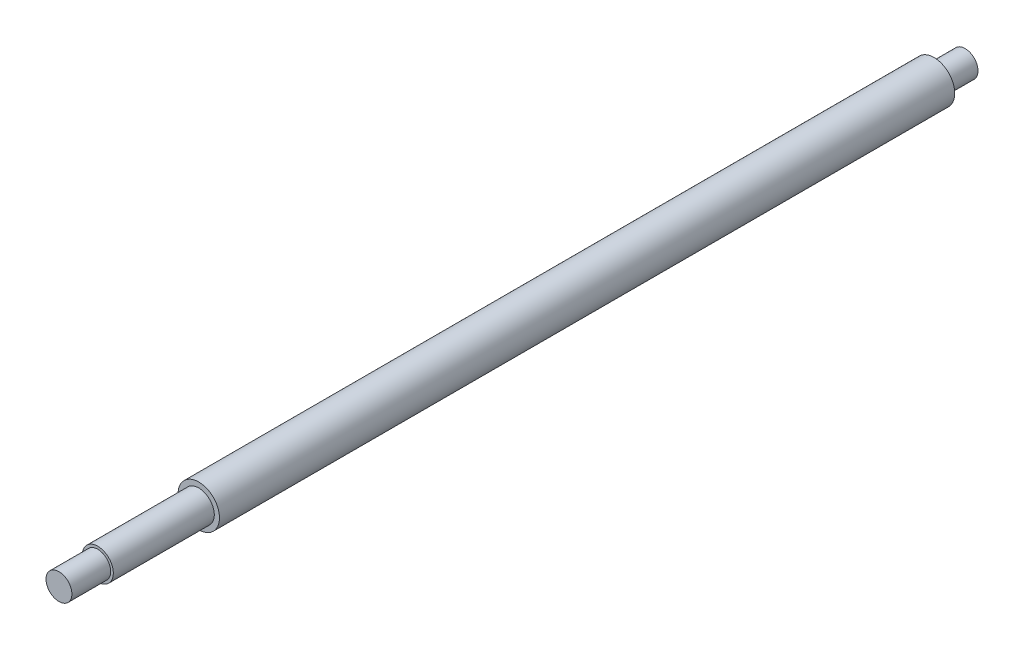
ISO-10303-21;
HEADER;
FILE_DESCRIPTION(('STEP AP214'),'2;1');
FILE_NAME('part.step','',(''),(''),'','','');
FILE_SCHEMA(('AUTOMOTIVE_DESIGN { 1 0 10303 214 1 1 1 1 }'));
ENDSEC;
DATA;
#1=APPLICATION_CONTEXT('core data for automotive mechanical design processes');
#2=APPLICATION_PROTOCOL_DEFINITION('international standard','automotive_design',2000,#1);
#3=PRODUCT_CONTEXT('',#1,'mechanical');
#4=PRODUCT('Part','Part','',(#3));
#5=PRODUCT_RELATED_PRODUCT_CATEGORY('part','',(#4));
#6=PRODUCT_DEFINITION_FORMATION('','',#4);
#7=PRODUCT_DEFINITION_CONTEXT('part definition',#1,'design');
#8=PRODUCT_DEFINITION('design','',#6,#7);
#9=PRODUCT_DEFINITION_SHAPE('','',#8);
#10=(LENGTH_UNIT() NAMED_UNIT(*) SI_UNIT(.MILLI.,.METRE.));
#11=(NAMED_UNIT(*) PLANE_ANGLE_UNIT() SI_UNIT($,.RADIAN.));
#12=(NAMED_UNIT(*) SI_UNIT($,.STERADIAN.) SOLID_ANGLE_UNIT());
#13=UNCERTAINTY_MEASURE_WITH_UNIT(LENGTH_MEASURE(1.E-05),#10,'distance_accuracy_value','');
#14=(GEOMETRIC_REPRESENTATION_CONTEXT(3) GLOBAL_UNCERTAINTY_ASSIGNED_CONTEXT((#13)) GLOBAL_UNIT_ASSIGNED_CONTEXT((#10,
#11,#12)) REPRESENTATION_CONTEXT('',''));
#15=CARTESIAN_POINT('',(0.,0.,0.));
#16=DIRECTION('',(0.,0.,1.));
#17=DIRECTION('',(1.,0.,0.));
#18=AXIS2_PLACEMENT_3D('',#15,#16,#17);
#19=CARTESIAN_POINT('',(0.,0.,338.680000000035));
#20=DIRECTION('',(0.,0.,1.));
#21=DIRECTION('',(1.,0.,0.));
#22=AXIS2_PLACEMENT_3D('',#19,#20,#21);
#23=PLANE('',#22);
#24=CARTESIAN_POINT('',(0.,0.,338.680000000035));
#25=DIRECTION('',(0.,0.,-1.));
#26=DIRECTION('',(-1.,0.,0.));
#27=AXIS2_PLACEMENT_3D('',#24,#25,#26);
#28=CIRCLE('',#27,4.99999999999996);
#29=CARTESIAN_POINT('',(-4.99999999999996,0.,338.680000000035));
#30=VERTEX_POINT('',#29);
#31=EDGE_CURVE('E12',#30,#30,#28,.T.);
#32=ORIENTED_EDGE('',*,*,#31,.F.);
#33=EDGE_LOOP('',(#32));
#34=FACE_BOUND('',#33,.T.);
#35=ADVANCED_FACE('F41',(#34),#23,.T.);
#36=CARTESIAN_POINT('',(0.,0.,0.));
#37=DIRECTION('',(0.,0.,-1.));
#38=DIRECTION('',(-1.,0.,0.));
#39=AXIS2_PLACEMENT_3D('',#36,#37,#38);
#40=CYLINDRICAL_SURFACE('',#39,4.99999999999996);
#41=ORIENTED_EDGE('',*,*,#31,.T.);
#42=EDGE_LOOP('',(#41));
#43=FACE_BOUND('',#42,.T.);
#44=CARTESIAN_POINT('',(0.,0.,323.680000000035));
#45=DIRECTION('',(0.,0.,-1.));
#46=DIRECTION('',(-1.,0.,0.));
#47=AXIS2_PLACEMENT_3D('',#44,#45,#46);
#48=CIRCLE('',#47,4.99999999999996);
#49=CARTESIAN_POINT('',(-4.99999999999996,0.,323.680000000035));
#50=VERTEX_POINT('',#49);
#51=EDGE_CURVE('E47',#50,#50,#48,.T.);
#52=ORIENTED_EDGE('',*,*,#51,.F.);
#53=EDGE_LOOP('',(#52));
#54=FACE_BOUND('',#53,.T.);
#55=ADVANCED_FACE('F89',(#43,#54),#40,.T.);
#56=CARTESIAN_POINT('',(0.,4.99999999999996,323.680000000035));
#57=DIRECTION('',(0.,0.,1.));
#58=DIRECTION('',(1.,0.,0.));
#59=AXIS2_PLACEMENT_3D('',#56,#57,#58);
#60=PLANE('',#59);
#61=ORIENTED_EDGE('',*,*,#51,.T.);
#62=EDGE_LOOP('',(#61));
#63=FACE_BOUND('',#62,.T.);
#64=CARTESIAN_POINT('',(0.,0.,323.680000000035));
#65=DIRECTION('',(0.,0.,-1.));
#66=DIRECTION('',(-1.,0.,0.));
#67=AXIS2_PLACEMENT_3D('',#64,#65,#66);
#68=CIRCLE('',#67,5.99999999999996);
#69=CARTESIAN_POINT('',(-5.99999999999996,0.,323.680000000035));
#70=VERTEX_POINT('',#69);
#71=EDGE_CURVE('E51',#70,#70,#68,.T.);
#72=ORIENTED_EDGE('',*,*,#71,.F.);
#73=EDGE_LOOP('',(#72));
#74=FACE_BOUND('',#73,.T.);
#75=ADVANCED_FACE('F94',(#63,#74),#60,.T.);
#76=CARTESIAN_POINT('',(0.,0.,0.));
#77=DIRECTION('',(0.,0.,-1.));
#78=DIRECTION('',(-1.,0.,0.));
#79=AXIS2_PLACEMENT_3D('',#76,#77,#78);
#80=CYLINDRICAL_SURFACE('',#79,5.99999999999996);
#81=ORIENTED_EDGE('',*,*,#71,.T.);
#82=EDGE_LOOP('',(#81));
#83=FACE_BOUND('',#82,.T.);
#84=CARTESIAN_POINT('',(0.,0.,284.680000000035));
#85=DIRECTION('',(0.,0.,-1.));
#86=DIRECTION('',(-1.,0.,0.));
#87=AXIS2_PLACEMENT_3D('',#84,#85,#86);
#88=CIRCLE('',#87,5.99999999999996);
#89=CARTESIAN_POINT('',(-5.99999999999996,0.,284.680000000035));
#90=VERTEX_POINT('',#89);
#91=EDGE_CURVE('E55',#90,#90,#88,.T.);
#92=ORIENTED_EDGE('',*,*,#91,.F.);
#93=EDGE_LOOP('',(#92));
#94=FACE_BOUND('',#93,.T.);
#95=ADVANCED_FACE('F98',(#83,#94),#80,.T.);
#96=CARTESIAN_POINT('',(0.,5.99999999999996,284.680000000035));
#97=DIRECTION('',(0.,0.,1.));
#98=DIRECTION('',(1.,0.,0.));
#99=AXIS2_PLACEMENT_3D('',#96,#97,#98);
#100=PLANE('',#99);
#101=ORIENTED_EDGE('',*,*,#91,.T.);
#102=EDGE_LOOP('',(#101));
#103=FACE_BOUND('',#102,.T.);
#104=CARTESIAN_POINT('',(0.,0.,284.680000000035));
#105=DIRECTION('',(0.,0.,-1.));
#106=DIRECTION('',(-1.,0.,0.));
#107=AXIS2_PLACEMENT_3D('',#104,#105,#106);
#108=CIRCLE('',#107,7.99999999999996);
#109=CARTESIAN_POINT('',(-7.99999999999996,0.,284.680000000035));
#110=VERTEX_POINT('',#109);
#111=EDGE_CURVE('E60',#110,#110,#108,.T.);
#112=ORIENTED_EDGE('',*,*,#111,.F.);
#113=EDGE_LOOP('',(#112));
#114=FACE_BOUND('',#113,.T.);
#115=ADVANCED_FACE('F104',(#103,#114),#100,.T.);
#116=CARTESIAN_POINT('',(0.,0.,0.));
#117=DIRECTION('',(0.,0.,-1.));
#118=DIRECTION('',(-1.,0.,0.));
#119=AXIS2_PLACEMENT_3D('',#116,#117,#118);
#120=CYLINDRICAL_SURFACE('',#119,7.99999999999997);
#121=ORIENTED_EDGE('',*,*,#111,.T.);
#122=EDGE_LOOP('',(#121));
#123=FACE_BOUND('',#122,.T.);
#124=CARTESIAN_POINT('',(0.,0.,0.680000000034518));
#125=DIRECTION('',(0.,0.,-1.));
#126=DIRECTION('',(-1.,0.,0.));
#127=AXIS2_PLACEMENT_3D('',#124,#125,#126);
#128=CIRCLE('',#127,7.99999999999997);
#129=CARTESIAN_POINT('',(-7.99999999999997,0.,0.680000000034518));
#130=VERTEX_POINT('',#129);
#131=EDGE_CURVE('E63',#130,#130,#128,.T.);
#132=ORIENTED_EDGE('',*,*,#131,.F.);
#133=EDGE_LOOP('',(#132));
#134=FACE_BOUND('',#133,.T.);
#135=ADVANCED_FACE('F85',(#123,#134),#120,.T.);
#136=CARTESIAN_POINT('',(0.,7.99999999999997,0.680000000034518));
#137=DIRECTION('',(0.,0.,-1.));
#138=DIRECTION('',(-1.,0.,0.));
#139=AXIS2_PLACEMENT_3D('',#136,#137,#138);
#140=PLANE('',#139);
#141=ORIENTED_EDGE('',*,*,#131,.T.);
#142=EDGE_LOOP('',(#141));
#143=FACE_BOUND('',#142,.T.);
#144=CARTESIAN_POINT('',(0.,0.,0.680000000034518));
#145=DIRECTION('',(0.,0.,-1.));
#146=DIRECTION('',(-1.,0.,0.));
#147=AXIS2_PLACEMENT_3D('',#144,#145,#146);
#148=CIRCLE('',#147,5.);
#149=CARTESIAN_POINT('',(-5.,0.,0.680000000034518));
#150=VERTEX_POINT('',#149);
#151=EDGE_CURVE('E66',#150,#150,#148,.T.);
#152=ORIENTED_EDGE('',*,*,#151,.F.);
#153=EDGE_LOOP('',(#152));
#154=FACE_BOUND('',#153,.T.);
#155=ADVANCED_FACE('F77',(#143,#154),#140,.T.);
#156=CARTESIAN_POINT('',(0.,0.,0.));
#157=DIRECTION('',(0.,0.,-1.));
#158=DIRECTION('',(-1.,0.,0.));
#159=AXIS2_PLACEMENT_3D('',#156,#157,#158);
#160=CYLINDRICAL_SURFACE('',#159,5.);
#161=ORIENTED_EDGE('',*,*,#151,.T.);
#162=EDGE_LOOP('',(#161));
#163=FACE_BOUND('',#162,.T.);
#164=CARTESIAN_POINT('',(0.,0.,-11.3199999999655));
#165=DIRECTION('',(0.,0.,-1.));
#166=DIRECTION('',(-1.,0.,0.));
#167=AXIS2_PLACEMENT_3D('',#164,#165,#166);
#168=CIRCLE('',#167,5.);
#169=CARTESIAN_POINT('',(-5.,0.,-11.3199999999655));
#170=VERTEX_POINT('',#169);
#171=EDGE_CURVE('E69',#170,#170,#168,.T.);
#172=ORIENTED_EDGE('',*,*,#171,.F.);
#173=EDGE_LOOP('',(#172));
#174=FACE_BOUND('',#173,.T.);
#175=ADVANCED_FACE('F75',(#163,#174),#160,.T.);
#176=CARTESIAN_POINT('',(0.,5.,-11.3199999999655));
#177=DIRECTION('',(0.,0.,-1.));
#178=DIRECTION('',(-1.,0.,0.));
#179=AXIS2_PLACEMENT_3D('',#176,#177,#178);
#180=PLANE('',#179);
#181=ORIENTED_EDGE('',*,*,#171,.T.);
#182=EDGE_LOOP('',(#181));
#183=FACE_BOUND('',#182,.T.);
#184=ADVANCED_FACE('F73',(#183),#180,.T.);
#185=CLOSED_SHELL('',(#35,#55,#75,#95,#115,#135,#155,#175,#184));
#186=MANIFOLD_SOLID_BREP('B2',#185);
#187=ADVANCED_BREP_SHAPE_REPRESENTATION('',(#18,#186),#14);
#188=SHAPE_DEFINITION_REPRESENTATION(#9,#187);
ENDSEC;
END-ISO-10303-21;
